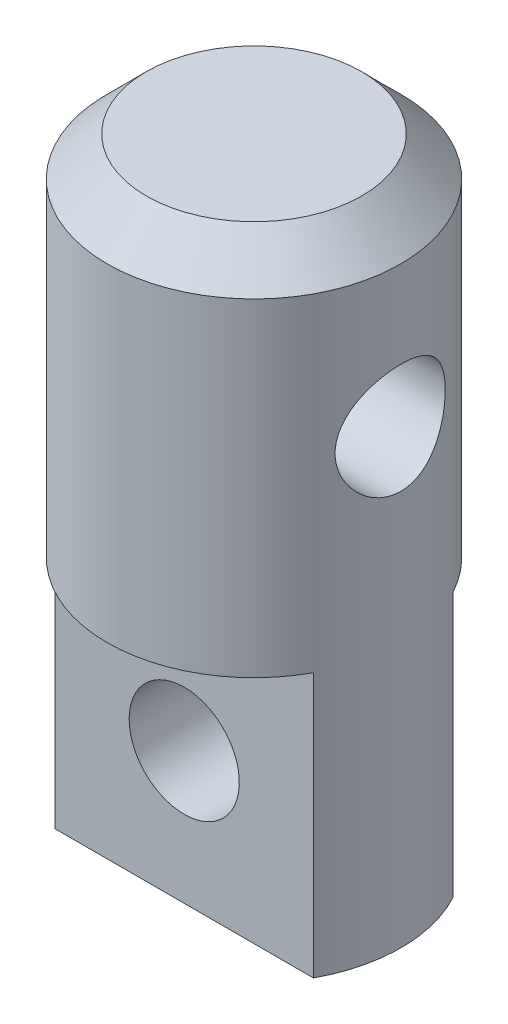
ISO-10303-21;
HEADER;
FILE_DESCRIPTION(('STEP AP214'),'2;1');
FILE_NAME('part.step','',(''),(''),'','','');
FILE_SCHEMA(('AUTOMOTIVE_DESIGN { 1 0 10303 214 1 1 1 1 }'));
ENDSEC;
DATA;
#1=APPLICATION_CONTEXT('core data for automotive mechanical design processes');
#2=APPLICATION_PROTOCOL_DEFINITION('international standard','automotive_design',2000,#1);
#3=PRODUCT_CONTEXT('',#1,'mechanical');
#4=PRODUCT('Part','Part','',(#3));
#5=PRODUCT_RELATED_PRODUCT_CATEGORY('part','',(#4));
#6=PRODUCT_DEFINITION_FORMATION('','',#4);
#7=PRODUCT_DEFINITION_CONTEXT('part definition',#1,'design');
#8=PRODUCT_DEFINITION('design','',#6,#7);
#9=PRODUCT_DEFINITION_SHAPE('','',#8);
#10=(LENGTH_UNIT() NAMED_UNIT(*) SI_UNIT(.MILLI.,.METRE.));
#11=(NAMED_UNIT(*) PLANE_ANGLE_UNIT() SI_UNIT($,.RADIAN.));
#12=(NAMED_UNIT(*) SI_UNIT($,.STERADIAN.) SOLID_ANGLE_UNIT());
#13=UNCERTAINTY_MEASURE_WITH_UNIT(LENGTH_MEASURE(1.E-05),#10,'distance_accuracy_value','');
#14=(GEOMETRIC_REPRESENTATION_CONTEXT(3) GLOBAL_UNCERTAINTY_ASSIGNED_CONTEXT((#13)) GLOBAL_UNIT_ASSIGNED_CONTEXT((#10,
#11,#12)) REPRESENTATION_CONTEXT('',''));
#15=CARTESIAN_POINT('',(0.,0.,0.));
#16=DIRECTION('',(0.,0.,1.));
#17=DIRECTION('',(1.,0.,0.));
#18=AXIS2_PLACEMENT_3D('',#15,#16,#17);
#19=CARTESIAN_POINT('',(0.,-25.8,0.));
#20=DIRECTION('',(0.,1.,0.));
#21=DIRECTION('',(0.,0.,1.));
#22=AXIS2_PLACEMENT_3D('',#19,#20,#21);
#23=CYLINDRICAL_SURFACE('',#22,6.);
#24=CARTESIAN_POINT('',(-6.,-5.15,0.));
#25=CARTESIAN_POINT('',(-6.00000326184227,-5.14999564654534,-0.121852588406779));
#26=CARTESIAN_POINT('',(-5.99625568924776,-5.15992964037258,-0.243675362672688));
#27=CARTESIAN_POINT('',(-5.98168044010391,-5.19924229290489,-0.483680178528541));
#28=CARTESIAN_POINT('',(-5.9708537834099,-5.22861815070585,-0.601862741981424));
#29=CARTESIAN_POINT('',(-5.94328248587317,-5.30562950265764,-0.831091177486318));
#30=CARTESIAN_POINT('',(-5.9265492652416,-5.35322977523268,-0.942150336243416));
#31=CARTESIAN_POINT('',(-5.8888315164803,-5.46515961952373,-1.15469896524038));
#32=CARTESIAN_POINT('',(-5.86784584841321,-5.52949367831623,-1.25618585876682));
#33=CARTESIAN_POINT('',(-5.82279370456825,-5.67591879660636,-1.45101962556874));
#34=CARTESIAN_POINT('',(-5.79864003875349,-5.7585953933891,-1.54390609522679));
#35=CARTESIAN_POINT('',(-5.7504033130699,-5.93811565198826,-1.71486632211545));
#36=CARTESIAN_POINT('',(-5.72632027702549,-6.03496363413181,-1.79293554538804));
#37=CARTESIAN_POINT('',(-5.67993705926597,-6.24457620128482,-1.93497303323978));
#38=CARTESIAN_POINT('',(-5.65773973231228,-6.35780654981873,-1.99829089793639));
#39=CARTESIAN_POINT('',(-5.6189979035615,-6.59427253125278,-2.10477969501127));
#40=CARTESIAN_POINT('',(-5.60245114463821,-6.71750414473265,-2.14795867441859));
#41=CARTESIAN_POINT('',(-5.57781619236204,-6.9651751103873,-2.21112646526324));
#42=CARTESIAN_POINT('',(-5.56940886526256,-7.08935755765316,-2.23199389827837));
#43=CARTESIAN_POINT('',(-5.56107092191822,-7.33972423699076,-2.25269334797472));
#44=CARTESIAN_POINT('',(-5.56113680488957,-7.4659076208117,-2.25253405203946));
#45=CARTESIAN_POINT('',(-5.56946267448082,-7.70865428781944,-2.23185644415027));
#46=CARTESIAN_POINT('',(-5.57723203306682,-7.82534135906627,-2.21255712763505));
#47=CARTESIAN_POINT('',(-5.59927407089294,-8.05368072560798,-2.15616251802495));
#48=CARTESIAN_POINT('',(-5.61354772948295,-8.16533225992082,-2.11906454494888));
#49=CARTESIAN_POINT('',(-5.64728553285379,-8.38291560159235,-2.02745622857856));
#50=CARTESIAN_POINT('',(-5.66684276982248,-8.48869922918195,-1.97262973105651));
#51=CARTESIAN_POINT('',(-5.70891315208979,-8.68991860638646,-1.84734110644047));
#52=CARTESIAN_POINT('',(-5.73142731685737,-8.78535076627955,-1.77687358093345));
#53=CARTESIAN_POINT('',(-5.77872058288669,-8.96990549547632,-1.61672671149823));
#54=CARTESIAN_POINT('',(-5.80355021183506,-9.05817296112214,-1.52607448075433));
#55=CARTESIAN_POINT('',(-5.85137592246128,-9.2185069493087,-1.33096888622853));
#56=CARTESIAN_POINT('',(-5.87437172198928,-9.29057098190851,-1.22651340524605));
#57=CARTESIAN_POINT('',(-5.9163959221362,-9.41739559559378,-1.00458515548863));
#58=CARTESIAN_POINT('',(-5.93535747389424,-9.47187137183159,-0.886936070767081));
#59=CARTESIAN_POINT('',(-5.96668077490443,-9.55997390640506,-0.643255275786876));
#60=CARTESIAN_POINT('',(-5.9790454551224,-9.59360992484168,-0.517227316268652));
#61=CARTESIAN_POINT('',(-5.99526664842098,-9.63743418131291,-0.267562864722999));
#62=CARTESIAN_POINT('',(-5.99954053538529,-9.64877390957377,-0.144155429343315));
#63=CARTESIAN_POINT('',(-6.00038840550189,-9.65103659584988,0.102858712882535));
#64=CARTESIAN_POINT('',(-5.99696409580295,-9.64196408047517,0.226465369475057));
#65=CARTESIAN_POINT('',(-5.98307564658965,-9.60453493653699,0.465393072842787));
#66=CARTESIAN_POINT('',(-5.97288706443457,-9.57693268439437,0.580849992011002));
#67=CARTESIAN_POINT('',(-5.94677215637576,-9.50422089117902,0.805412632435829));
#68=CARTESIAN_POINT('',(-5.93084508423045,-9.45910907307795,0.9145175255213));
#69=CARTESIAN_POINT('',(-5.89424436611522,-9.35122038134079,1.12687164766523));
#70=CARTESIAN_POINT('',(-5.87344500314022,-9.28796340616492,1.22985462533669));
#71=CARTESIAN_POINT('',(-5.82940007346996,-9.14612284524267,1.42408906758994));
#72=CARTESIAN_POINT('',(-5.80615360514274,-9.06753360118227,1.51533618040567));
#73=CARTESIAN_POINT('',(-5.75809994236484,-8.89189381681359,1.68904619811681));
#74=CARTESIAN_POINT('',(-5.73328044755594,-8.79403672584095,1.77069231185353));
#75=CARTESIAN_POINT('',(-5.6861822362028,-8.58552292293852,1.91656575047855));
#76=CARTESIAN_POINT('',(-5.66390374791599,-8.47486506291725,1.98079151121777));
#77=CARTESIAN_POINT('',(-5.62450244733695,-8.24297601984153,2.09006660278496));
#78=CARTESIAN_POINT('',(-5.6074014049274,-8.12170288113435,2.13503528170377));
#79=CARTESIAN_POINT('',(-5.58081049336508,-7.87248535446827,2.20361825200333));
#80=CARTESIAN_POINT('',(-5.57131591586236,-7.74454514570282,2.22724575458302));
#81=CARTESIAN_POINT('',(-5.5616384218886,-7.49447576068833,2.25129520646758));
#82=CARTESIAN_POINT('',(-5.56089666785011,-7.37250105242467,2.25310997243756));
#83=CARTESIAN_POINT('',(-5.56737619117938,-7.13008202558575,2.23705073462389));
#84=CARTESIAN_POINT('',(-5.57459671348348,-7.00963756299263,2.21917859775185));
#85=CARTESIAN_POINT('',(-5.59572212378149,-6.77742915992517,2.16533723445362));
#86=CARTESIAN_POINT('',(-5.60941628064994,-6.66551248063198,2.12993697474786));
#87=CARTESIAN_POINT('',(-5.64182322446767,-6.44914173725837,2.04254545169879));
#88=CARTESIAN_POINT('',(-5.66053727992822,-6.34468956789479,1.99054999417417));
#89=CARTESIAN_POINT('',(-5.70209585855947,-6.14025981545355,1.8682811390723));
#90=CARTESIAN_POINT('',(-5.72510547661446,-6.04080380480013,1.79719249204515));
#91=CARTESIAN_POINT('',(-5.77209370135766,-5.8547876585432,1.64001728594859));
#92=CARTESIAN_POINT('',(-5.79607261414718,-5.76823163781987,1.55392596019212));
#93=CARTESIAN_POINT('',(-5.84385636914822,-5.60569706626724,1.36362059517693));
#94=CARTESIAN_POINT('',(-5.86758157350967,-5.53054436984799,1.25867796631949));
#95=CARTESIAN_POINT('',(-5.91081771685546,-5.39896601708517,1.03681983480123));
#96=CARTESIAN_POINT('',(-5.93032832777339,-5.34254181839545,0.919903401135932));
#97=CARTESIAN_POINT('',(-5.9636143891002,-5.24843475642751,0.671998623003468));
#98=CARTESIAN_POINT('',(-5.97710485737534,-5.21166940309716,0.540620133351313));
#99=CARTESIAN_POINT('',(-5.9952936326938,-5.16246056011898,0.272813600409574));
#100=CARTESIAN_POINT('',(-5.9999963490595,-5.15000487276902,0.136388124547289));
#101=CARTESIAN_POINT('',(-6.,-5.15,0.));
#102=B_SPLINE_CURVE_WITH_KNOTS('',3,(#24,#25,#26,#27,#28,#29,#30,#31,#32,#33,#34,#35,#36,#37,
#38,#39,#40,#41,#42,#43,#44,#45,#46,#47,#48,#49,#50,#51,#52,#53,#54,#55,#56,#57,#58,#59,#60,#61,
#62,#63,#64,#65,#66,#67,#68,#69,#70,#71,#72,#73,#74,#75,#76,#77,#78,#79,#80,#81,#82,#83,#84,#85,
#86,#87,#88,#89,#90,#91,#92,#93,#94,#95,#96,#97,#98,#99,#100,#101),.UNSPECIFIED.,.T.,.F.,(4,2,2,
2,2,2,2,2,2,2,2,2,2,2,2,2,2,2,2,2,2,2,2,2,2,2,2,2,2,2,2,2,2,2,2,2,2,2,4),(0.,0.36505470234084,
0.730056824295691,1.09435705382036,1.45875506941424,1.83710427874073,2.21556907388432,
2.60845011752488,3.001174040282,3.37778811625352,3.75424659119561,4.10817517679957,
4.46215707090883,4.82283612580527,5.18363986116387,5.56869230003719,5.95380386857599,
6.34487062929113,6.73576349548268,7.10587529453888,7.4759050258578,7.8317165688576,
8.1875743988168,8.55388832789399,8.92033770029801,9.30804779183486,9.69579268380211,
10.0851460009081,10.4742581243476,10.8383814522038,11.2024702531689,11.555447136398,
11.9085132998476,12.2800870782641,12.6517791299559,13.0435849448106,13.4354212470765,
13.8442277254806,14.2528290269419),.UNSPECIFIED.);
#103=CARTESIAN_POINT('',(-6.,-5.15,0.));
#104=VERTEX_POINT('',#103);
#105=EDGE_CURVE('E11',#104,#104,#102,.T.);
#106=ORIENTED_EDGE('',*,*,#105,.F.);
#107=EDGE_LOOP('',(#106));
#108=FACE_BOUND('',#107,.T.);
#109=CARTESIAN_POINT('',(5.56214886532175,-7.4,-2.25));
#110=CARTESIAN_POINT('',(5.5621446091142,-7.27848877438745,-2.25000456158466));
#111=CARTESIAN_POINT('',(5.56617390222235,-7.15700761615536,-2.24012396321523));
#112=CARTESIAN_POINT('',(5.58174238819324,-6.91770787554859,-2.20104281840612));
#113=CARTESIAN_POINT('',(5.59328135613602,-6.79988918359124,-2.17184285059449));
#114=CARTESIAN_POINT('',(5.62238220458168,-6.57143694260838,-2.09534486416723));
#115=CARTESIAN_POINT('',(5.63992964363772,-6.46078691503107,-2.04809020899754));
#116=CARTESIAN_POINT('',(5.67904701300013,-6.24894215476404,-1.93697785113815));
#117=CARTESIAN_POINT('',(5.70061815098282,-6.14775027457412,-1.87311516142495));
#118=CARTESIAN_POINT('',(5.74655362001394,-5.95266453256797,-1.72719992061309));
#119=CARTESIAN_POINT('',(5.77100012886163,-5.8593072055565,-1.64445571819977));
#120=CARTESIAN_POINT('',(5.81924625942062,-5.68741577799218,-1.46459375966821));
#121=CARTESIAN_POINT('',(5.84304574221971,-5.60888483938706,-1.36747294538497));
#122=CARTESIAN_POINT('',(5.88829310905042,-5.46629073155675,-1.15754198276645));
#123=CARTESIAN_POINT('',(5.90963341835315,-5.40281078792626,-1.04431042130706));
#124=CARTESIAN_POINT('',(5.94657011960714,-5.29602324121259,-0.807833657947859));
#125=CARTESIAN_POINT('',(5.96216850325495,-5.25270864201203,-0.684591946400301));
#126=CARTESIAN_POINT('',(5.98528045655172,-5.18936315633809,-0.437234012515254));
#127=CARTESIAN_POINT('',(5.99311372822162,-5.16840855883932,-0.313384795922399));
#128=CARTESIAN_POINT('',(6.0009602116191,-5.14741819858252,-0.0636965456921769));
#129=CARTESIAN_POINT('',(6.00097596622365,-5.14737563357195,0.0621418275942582));
#130=CARTESIAN_POINT('',(5.9933889885583,-5.16767264219775,0.305615314596703));
#131=CARTESIAN_POINT('',(5.9861631299498,-5.18700394692317,0.423348267400315));
#132=CARTESIAN_POINT('',(5.96539912398439,-5.24380387283838,0.65375882697662));
#133=CARTESIAN_POINT('',(5.95186052963534,-5.28127377839326,0.766436075145573));
#134=CARTESIAN_POINT('',(5.91956653751126,-5.37375567751357,0.985483525954526));
#135=CARTESIAN_POINT('',(5.90073809204477,-5.42901500790184,1.09173808843048));
#136=CARTESIAN_POINT('',(5.85976965338557,-5.55528814539485,1.29372991193682));
#137=CARTESIAN_POINT('',(5.83762859271643,-5.62630703452928,1.38946376540029));
#138=CARTESIAN_POINT('',(5.79078794481202,-5.78694092942174,1.57363573019949));
#139=CARTESIAN_POINT('',(5.76601445636153,-5.87740087346398,1.6613192178879));
#140=CARTESIAN_POINT('',(5.71773690978256,-6.071889489994,1.82055593354745));
#141=CARTESIAN_POINT('',(5.69423317159444,-6.17592155992357,1.89210511042087));
#142=CARTESIAN_POINT('',(5.65069055213362,-6.39757920115802,2.01848417709906));
#143=CARTESIAN_POINT('',(5.63074015585677,-6.5154552403786,2.07290771768008));
#144=CARTESIAN_POINT('',(5.59758657804233,-6.75964433759582,2.16084696652386));
#145=CARTESIAN_POINT('',(5.58437964272364,-6.88595265734428,2.19437430905775));
#146=CARTESIAN_POINT('',(5.56709395868655,-7.13596394350661,2.23785287566784));
#147=CARTESIAN_POINT('',(5.56255177871502,-7.25942615831295,2.24900281739059));
#148=CARTESIAN_POINT('',(5.56179809278329,-7.50651403510387,2.25086828453798));
#149=CARTESIAN_POINT('',(5.56558450503571,-7.63013964852642,2.24158891640483));
#150=CARTESIAN_POINT('',(5.58059072446896,-7.8678948834337,2.20394600280387));
#151=CARTESIAN_POINT('',(5.59144914325288,-7.98219670364757,2.17650927501378));
#152=CARTESIAN_POINT('',(5.61894730568927,-8.2045219170797,2.10449661960915));
#153=CARTESIAN_POINT('',(5.63558823375091,-8.31254401875204,2.05991718051923));
#154=CARTESIAN_POINT('',(5.67354364674293,-8.52374665711447,1.95300438412928));
#155=CARTESIAN_POINT('',(5.69500993338144,-8.62659393820605,1.89006817765573));
#156=CARTESIAN_POINT('',(5.7399422144139,-8.82069347258901,1.74886976793715));
#157=CARTESIAN_POINT('',(5.76340893891102,-8.91194146193694,1.67060195544651));
#158=CARTESIAN_POINT('',(5.8114956982979,-9.08625255979266,1.49509101135141));
#159=CARTESIAN_POINT('',(5.83609454035545,-9.16843011315313,1.39695951223659));
#160=CARTESIAN_POINT('',(5.88224812444949,-9.31525755138415,1.18769620762972));
#161=CARTESIAN_POINT('',(5.90380285661495,-9.37990737941876,1.07656435998401));
#162=CARTESIAN_POINT('',(5.94142478556828,-9.48941908429942,0.844524494202715));
#163=CARTESIAN_POINT('',(5.95751072007015,-9.5343486856889,0.72365164959694));
#164=CARTESIAN_POINT('',(5.98244155068856,-9.60298462077488,0.475322831284881));
#165=CARTESIAN_POINT('',(5.99128984949119,-9.6267009281336,0.347869981085388));
#166=CARTESIAN_POINT('',(6.0004261097561,-9.65116160413224,0.0980033779107219));
#167=CARTESIAN_POINT('',(6.00118291430646,-9.65316422458849,-0.0242711520912693));
#168=CARTESIAN_POINT('',(5.99527334713835,-9.63737726083191,-0.267340179618637));
#169=CARTESIAN_POINT('',(5.98860787069696,-9.61959006367122,-0.388134853867887));
#170=CARTESIAN_POINT('',(5.96881634405656,-9.56561172275957,-0.62182237256569));
#171=CARTESIAN_POINT('',(5.95585187067022,-9.52988014118246,-0.734836096603252));
#172=CARTESIAN_POINT('',(5.92481675431488,-9.44148497992346,-0.953273209509586));
#173=CARTESIAN_POINT('',(5.90674514483509,-9.38881819504288,-1.05869515691332));
#174=CARTESIAN_POINT('',(5.86635927450097,-9.26552908474278,-1.26381026549162));
#175=CARTESIAN_POINT('',(5.8438986016319,-9.19424503922876,-1.36307632327026));
#176=CARTESIAN_POINT('',(5.79749261542319,-9.03678825471862,-1.54862602128505));
#177=CARTESIAN_POINT('',(5.77354677411237,-8.95061020128827,-1.63490500688388));
#178=CARTESIAN_POINT('',(5.72532194608555,-8.76040380253232,-1.7967182135429));
#179=CARTESIAN_POINT('',(5.70109208022947,-8.65567339676819,-1.87144499724024));
#180=CARTESIAN_POINT('',(5.6564748750625,-8.43437619564036,-2.00227064335279));
#181=CARTESIAN_POINT('',(5.6360879344979,-8.31780817392107,-2.05836757317288));
#182=CARTESIAN_POINT('',(5.60103404776804,-8.07056647853554,-2.15198830461336));
#183=CARTESIAN_POINT('',(5.58665704924502,-7.93949845022719,-2.18859004349075));
#184=CARTESIAN_POINT('',(5.56721991516253,-7.67227209207145,-2.23758535083328));
#185=CARTESIAN_POINT('',(5.56215363313617,-7.53611718095418,-2.24999489010138));
#186=CARTESIAN_POINT('',(5.56214886532175,-7.4,-2.25));
#187=B_SPLINE_CURVE_WITH_KNOTS('',3,(#109,#110,#111,#112,#113,#114,#115,#116,#117,#118,#119,
#120,#121,#122,#123,#124,#125,#126,#127,#128,#129,#130,#131,#132,#133,#134,#135,#136,#137,#138,
#139,#140,#141,#142,#143,#144,#145,#146,#147,#148,#149,#150,#151,#152,#153,#154,#155,#156,#157,
#158,#159,#160,#161,#162,#163,#164,#165,#166,#167,#168,#169,#170,#171,#172,#173,#174,#175,#176,
#177,#178,#179,#180,#181,#182,#183,#184,#185,#186),.UNSPECIFIED.,.T.,.F.,(4,2,2,2,2,2,2,2,2,2,2,
2,2,2,2,2,2,2,2,2,2,2,2,2,2,2,2,2,2,2,2,2,2,2,2,2,2,2,4),(0.,0.364026812166974,
0.728042721980752,1.09118978521801,1.45444601960687,1.83411978609939,2.21387443242721,
2.60655108212878,2.99909139580242,3.37470027742765,3.75018698115533,4.10709709213038,
4.4640324790325,4.82616196824249,5.1884084045171,5.57185012607059,5.95538801749249,
6.34743888390625,6.73927127467942,7.10948486625458,7.47960593098057,7.83215768907028,
8.18478170159019,8.55062341523462,8.91659922714263,9.30577525505166,9.69495254489997,
10.0827826334998,10.4704302835492,10.8354858083963,11.2004973049395,11.5566041102057,
11.9127783528398,12.2839248553021,12.6552040635718,13.0460789932785,13.4369944583109,
13.8450476832112,14.2528314349931),.UNSPECIFIED.);
#188=CARTESIAN_POINT('',(5.56214886532175,-7.4,-2.25));
#189=VERTEX_POINT('',#188);
#190=EDGE_CURVE('E61',#189,#189,#187,.T.);
#191=ORIENTED_EDGE('',*,*,#190,.F.);
#192=EDGE_LOOP('',(#191));
#193=FACE_BOUND('',#192,.T.);
#194=CARTESIAN_POINT('',(0.,-1.6,0.));
#195=DIRECTION('',(0.,1.,0.));
#196=DIRECTION('',(0.,0.,1.));
#197=AXIS2_PLACEMENT_3D('',#194,#195,#196);
#198=CIRCLE('',#197,6.);
#199=CARTESIAN_POINT('',(0.,-1.6,6.));
#200=VERTEX_POINT('',#199);
#201=EDGE_CURVE('E132',#200,#200,#198,.F.);
#202=ORIENTED_EDGE('',*,*,#201,.T.);
#203=EDGE_LOOP('',(#202));
#204=FACE_BOUND('',#203,.T.);
#205=CARTESIAN_POINT('',(0.,-15.,0.));
#206=DIRECTION('',(0.,-1.,0.));
#207=DIRECTION('',(0.,0.,-1.));
#208=AXIS2_PLACEMENT_3D('',#205,#206,#207);
#209=CIRCLE('',#208,6.);
#210=CARTESIAN_POINT('',(5.27991477203941,-15.,-2.85));
#211=VERTEX_POINT('',#210);
#212=CARTESIAN_POINT('',(-5.27991477203941,-15.,-2.85));
#213=VERTEX_POINT('',#212);
#214=EDGE_CURVE('E102',#211,#213,#209,.F.);
#215=ORIENTED_EDGE('',*,*,#214,.T.);
#216=DIRECTION('',(0.,1.,0.));
#217=VECTOR('',#216,1.);
#218=CARTESIAN_POINT('',(-5.27991477203941,-25.8,-2.85));
#219=LINE('',#218,#217);
#220=CARTESIAN_POINT('',(-5.27991477203941,-25.8,-2.85));
#221=VERTEX_POINT('',#220);
#222=EDGE_CURVE('E119',#213,#221,#219,.F.);
#223=ORIENTED_EDGE('',*,*,#222,.T.);
#224=CARTESIAN_POINT('',(0.,-25.8,0.));
#225=DIRECTION('',(0.,1.,0.));
#226=DIRECTION('',(0.,0.,1.));
#227=AXIS2_PLACEMENT_3D('',#224,#225,#226);
#228=CIRCLE('',#227,6.);
#229=CARTESIAN_POINT('',(-5.27991477203941,-25.8,2.85));
#230=VERTEX_POINT('',#229);
#231=EDGE_CURVE('E114',#221,#230,#228,.T.);
#232=ORIENTED_EDGE('',*,*,#231,.T.);
#233=DIRECTION('',(0.,1.,0.));
#234=VECTOR('',#233,1.);
#235=CARTESIAN_POINT('',(-5.27991477203941,-25.8,2.85));
#236=LINE('',#235,#234);
#237=CARTESIAN_POINT('',(-5.27991477203941,-15.,2.85));
#238=VERTEX_POINT('',#237);
#239=EDGE_CURVE('E68',#238,#230,#236,.F.);
#240=ORIENTED_EDGE('',*,*,#239,.F.);
#241=CARTESIAN_POINT('',(0.,-15.,0.));
#242=DIRECTION('',(0.,-1.,0.));
#243=DIRECTION('',(0.,0.,-1.));
#244=AXIS2_PLACEMENT_3D('',#241,#242,#243);
#245=CIRCLE('',#244,6.);
#246=CARTESIAN_POINT('',(5.27991477203941,-15.,2.85));
#247=VERTEX_POINT('',#246);
#248=EDGE_CURVE('E96',#238,#247,#245,.F.);
#249=ORIENTED_EDGE('',*,*,#248,.T.);
#250=DIRECTION('',(0.,1.,0.));
#251=VECTOR('',#250,1.);
#252=CARTESIAN_POINT('',(5.27991477203941,-25.8,2.85));
#253=LINE('',#252,#251);
#254=CARTESIAN_POINT('',(5.27991477203941,-25.8,2.85));
#255=VERTEX_POINT('',#254);
#256=EDGE_CURVE('E106',#255,#247,#253,.T.);
#257=ORIENTED_EDGE('',*,*,#256,.F.);
#258=CARTESIAN_POINT('',(5.27991477203941,-25.8,-2.85));
#259=VERTEX_POINT('',#258);
#260=EDGE_CURVE('E127',#255,#259,#228,.T.);
#261=ORIENTED_EDGE('',*,*,#260,.T.);
#262=DIRECTION('',(0.,1.,0.));
#263=VECTOR('',#262,1.);
#264=CARTESIAN_POINT('',(5.27991477203941,-25.8,-2.85));
#265=LINE('',#264,#263);
#266=EDGE_CURVE('E76',#259,#211,#265,.T.);
#267=ORIENTED_EDGE('',*,*,#266,.T.);
#268=EDGE_LOOP('',(#215,#223,#232,#240,#249,#257,#261,#267));
#269=FACE_BOUND('',#268,.T.);
#270=ADVANCED_FACE('F47',(#108,#193,#204,#269),#23,.T.);
#271=CARTESIAN_POINT('',(0.,-25.8,0.));
#272=DIRECTION('',(0.,1.,0.));
#273=DIRECTION('',(0.,0.,1.));
#274=AXIS2_PLACEMENT_3D('',#271,#272,#273);
#275=PLANE('',#274);
#276=DIRECTION('',(-1.,0.,0.));
#277=VECTOR('',#276,1.);
#278=CARTESIAN_POINT('',(0.,-25.8,-2.85));
#279=LINE('',#278,#277);
#280=EDGE_CURVE('E103',#259,#221,#279,.T.);
#281=ORIENTED_EDGE('',*,*,#280,.F.);
#282=ORIENTED_EDGE('',*,*,#260,.F.);
#283=DIRECTION('',(-1.,0.,0.));
#284=VECTOR('',#283,1.);
#285=CARTESIAN_POINT('',(0.,-25.8,2.85));
#286=LINE('',#285,#284);
#287=EDGE_CURVE('E136',#255,#230,#286,.T.);
#288=ORIENTED_EDGE('',*,*,#287,.T.);
#289=ORIENTED_EDGE('',*,*,#231,.F.);
#290=EDGE_LOOP('',(#281,#282,#288,#289));
#291=FACE_BOUND('',#290,.T.);
#292=ADVANCED_FACE('F176',(#291),#275,.F.);
#293=CARTESIAN_POINT('',(0.,0.,0.));
#294=DIRECTION('',(0.,1.,0.));
#295=DIRECTION('',(0.,0.,1.));
#296=AXIS2_PLACEMENT_3D('',#293,#294,#295);
#297=PLANE('',#296);
#298=CARTESIAN_POINT('',(0.,0.,0.));
#299=DIRECTION('',(0.,1.,0.));
#300=DIRECTION('',(0.,0.,1.));
#301=AXIS2_PLACEMENT_3D('',#298,#299,#300);
#302=CIRCLE('',#301,4.4);
#303=CARTESIAN_POINT('',(0.,0.,4.4));
#304=VERTEX_POINT('',#303);
#305=EDGE_CURVE('E128',#304,#304,#302,.T.);
#306=ORIENTED_EDGE('',*,*,#305,.T.);
#307=EDGE_LOOP('',(#306));
#308=FACE_BOUND('',#307,.T.);
#309=ADVANCED_FACE('F178',(#308),#297,.T.);
#310=CARTESIAN_POINT('',(0.,0.,0.));
#311=DIRECTION('',(0.,-1.,0.));
#312=DIRECTION('',(0.,0.,-1.));
#313=AXIS2_PLACEMENT_3D('',#310,#311,#312);
#314=CONICAL_SURFACE('',#313,4.4,0.785398163397449);
#315=ORIENTED_EDGE('',*,*,#201,.F.);
#316=EDGE_LOOP('',(#315));
#317=FACE_BOUND('',#316,.T.);
#318=ORIENTED_EDGE('',*,*,#305,.F.);
#319=EDGE_LOOP('',(#318));
#320=FACE_BOUND('',#319,.T.);
#321=ADVANCED_FACE('F50',(#317,#320),#314,.T.);
#322=CARTESIAN_POINT('',(-6.,-15.,6.));
#323=DIRECTION('',(0.,-1.,0.));
#324=DIRECTION('',(0.,0.,-1.));
#325=AXIS2_PLACEMENT_3D('',#322,#323,#324);
#326=PLANE('',#325);
#327=DIRECTION('',(1.,0.,0.));
#328=VECTOR('',#327,1.);
#329=CARTESIAN_POINT('',(-6.,-15.,2.85));
#330=LINE('',#329,#328);
#331=EDGE_CURVE('E98',#238,#247,#330,.T.);
#332=ORIENTED_EDGE('',*,*,#331,.T.);
#333=ORIENTED_EDGE('',*,*,#248,.F.);
#334=EDGE_LOOP('',(#332,#333));
#335=FACE_BOUND('',#334,.T.);
#336=ADVANCED_FACE('F97',(#335),#326,.T.);
#337=CARTESIAN_POINT('',(-6.,-25.8,2.85));
#338=DIRECTION('',(0.,0.,-1.));
#339=DIRECTION('',(-1.,0.,0.));
#340=AXIS2_PLACEMENT_3D('',#337,#338,#339);
#341=PLANE('',#340);
#342=CARTESIAN_POINT('',(0.,-20.4,2.85));
#343=DIRECTION('',(0.,0.,-1.));
#344=DIRECTION('',(-1.,0.,0.));
#345=AXIS2_PLACEMENT_3D('',#342,#343,#344);
#346=CIRCLE('',#345,2.25);
#347=CARTESIAN_POINT('',(-2.25,-20.4,2.85));
#348=VERTEX_POINT('',#347);
#349=EDGE_CURVE('E109',#348,#348,#346,.T.);
#350=ORIENTED_EDGE('',*,*,#349,.T.);
#351=EDGE_LOOP('',(#350));
#352=FACE_BOUND('',#351,.T.);
#353=ORIENTED_EDGE('',*,*,#239,.T.);
#354=ORIENTED_EDGE('',*,*,#287,.F.);
#355=ORIENTED_EDGE('',*,*,#256,.T.);
#356=ORIENTED_EDGE('',*,*,#331,.F.);
#357=EDGE_LOOP('',(#353,#354,#355,#356));
#358=FACE_BOUND('',#357,.T.);
#359=ADVANCED_FACE('F105',(#352,#358),#341,.F.);
#360=CARTESIAN_POINT('',(-6.,-25.8,-2.85));
#361=DIRECTION('',(0.,0.,-1.));
#362=DIRECTION('',(0.,1.,0.));
#363=AXIS2_PLACEMENT_3D('',#360,#361,#362);
#364=PLANE('',#363);
#365=CARTESIAN_POINT('',(0.,-20.4,-2.85));
#366=DIRECTION('',(0.,0.,-1.));
#367=DIRECTION('',(0.,1.,0.));
#368=AXIS2_PLACEMENT_3D('',#365,#366,#367);
#369=CIRCLE('',#368,2.25);
#370=CARTESIAN_POINT('',(0.,-18.15,-2.85));
#371=VERTEX_POINT('',#370);
#372=EDGE_CURVE('E143',#371,#371,#369,.T.);
#373=ORIENTED_EDGE('',*,*,#372,.F.);
#374=EDGE_LOOP('',(#373));
#375=FACE_BOUND('',#374,.T.);
#376=DIRECTION('',(1.,0.,0.));
#377=VECTOR('',#376,1.);
#378=CARTESIAN_POINT('',(-6.,-15.,-2.85));
#379=LINE('',#378,#377);
#380=EDGE_CURVE('E108',#213,#211,#379,.T.);
#381=ORIENTED_EDGE('',*,*,#380,.T.);
#382=ORIENTED_EDGE('',*,*,#266,.F.);
#383=ORIENTED_EDGE('',*,*,#280,.T.);
#384=ORIENTED_EDGE('',*,*,#222,.F.);
#385=EDGE_LOOP('',(#381,#382,#383,#384));
#386=FACE_BOUND('',#385,.T.);
#387=ADVANCED_FACE('F166',(#375,#386),#364,.T.);
#388=CARTESIAN_POINT('',(-6.,-15.,-2.85));
#389=DIRECTION('',(0.,-1.,0.));
#390=DIRECTION('',(0.,0.,-1.));
#391=AXIS2_PLACEMENT_3D('',#388,#389,#390);
#392=PLANE('',#391);
#393=ORIENTED_EDGE('',*,*,#214,.F.);
#394=ORIENTED_EDGE('',*,*,#380,.F.);
#395=EDGE_LOOP('',(#393,#394));
#396=FACE_BOUND('',#395,.T.);
#397=ADVANCED_FACE('F162',(#396),#392,.T.);
#398=CARTESIAN_POINT('',(0.,-20.4,-6.));
#399=DIRECTION('',(0.,0.,1.));
#400=DIRECTION('',(1.,0.,0.));
#401=AXIS2_PLACEMENT_3D('',#398,#399,#400);
#402=CYLINDRICAL_SURFACE('',#401,2.25);
#403=ORIENTED_EDGE('',*,*,#372,.T.);
#404=EDGE_LOOP('',(#403));
#405=FACE_BOUND('',#404,.T.);
#406=ORIENTED_EDGE('',*,*,#349,.F.);
#407=EDGE_LOOP('',(#406));
#408=FACE_BOUND('',#407,.T.);
#409=ADVANCED_FACE('F157',(#405,#408),#402,.F.);
#410=CARTESIAN_POINT('',(-6.,-7.4,0.));
#411=DIRECTION('',(1.,0.,0.));
#412=DIRECTION('',(0.,0.,-1.));
#413=AXIS2_PLACEMENT_3D('',#410,#411,#412);
#414=CYLINDRICAL_SURFACE('',#413,2.25);
#415=ORIENTED_EDGE('',*,*,#105,.T.);
#416=EDGE_LOOP('',(#415));
#417=FACE_BOUND('',#416,.T.);
#418=ORIENTED_EDGE('',*,*,#190,.T.);
#419=EDGE_LOOP('',(#418));
#420=FACE_BOUND('',#419,.T.);
#421=ADVANCED_FACE('F153',(#417,#420),#414,.F.);
#422=CLOSED_SHELL('',(#270,#292,#309,#321,#336,#359,#387,#397,#409,#421));
#423=MANIFOLD_SOLID_BREP('B2',#422);
#424=ADVANCED_BREP_SHAPE_REPRESENTATION('',(#18,#423),#14);
#425=SHAPE_DEFINITION_REPRESENTATION(#9,#424);
ENDSEC;
END-ISO-10303-21;
